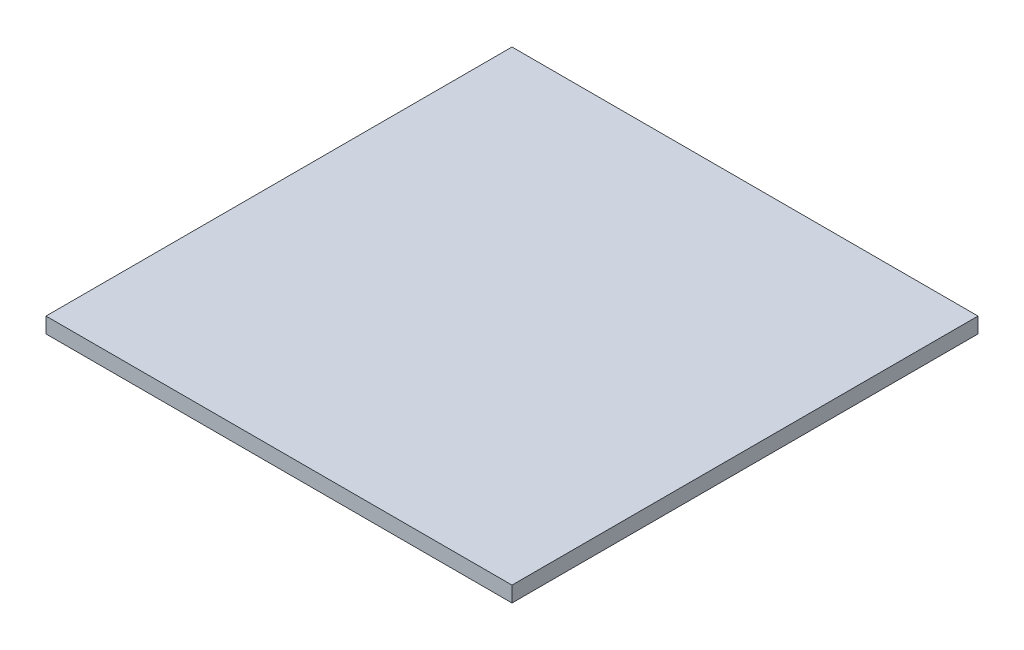
ISO-10303-21;
HEADER;
FILE_DESCRIPTION(('STEP AP214'),'2;1');
FILE_NAME('part.step','',(''),(''),'','','');
FILE_SCHEMA(('AUTOMOTIVE_DESIGN { 1 0 10303 214 1 1 1 1 }'));
ENDSEC;
DATA;
#1=APPLICATION_CONTEXT('core data for automotive mechanical design processes');
#2=APPLICATION_PROTOCOL_DEFINITION('international standard','automotive_design',2000,#1);
#3=PRODUCT_CONTEXT('',#1,'mechanical');
#4=PRODUCT('Part','Part','',(#3));
#5=PRODUCT_RELATED_PRODUCT_CATEGORY('part','',(#4));
#6=PRODUCT_DEFINITION_FORMATION('','',#4);
#7=PRODUCT_DEFINITION_CONTEXT('part definition',#1,'design');
#8=PRODUCT_DEFINITION('design','',#6,#7);
#9=PRODUCT_DEFINITION_SHAPE('','',#8);
#10=(LENGTH_UNIT() NAMED_UNIT(*) SI_UNIT(.MILLI.,.METRE.));
#11=(NAMED_UNIT(*) PLANE_ANGLE_UNIT() SI_UNIT($,.RADIAN.));
#12=(NAMED_UNIT(*) SI_UNIT($,.STERADIAN.) SOLID_ANGLE_UNIT());
#13=UNCERTAINTY_MEASURE_WITH_UNIT(LENGTH_MEASURE(1.E-05),#10,'distance_accuracy_value','');
#14=(GEOMETRIC_REPRESENTATION_CONTEXT(3) GLOBAL_UNCERTAINTY_ASSIGNED_CONTEXT((#13)) GLOBAL_UNIT_ASSIGNED_CONTEXT((#10,
#11,#12)) REPRESENTATION_CONTEXT('',''));
#15=CARTESIAN_POINT('',(0.,0.,0.));
#16=DIRECTION('',(0.,0.,1.));
#17=DIRECTION('',(1.,0.,0.));
#18=AXIS2_PLACEMENT_3D('',#15,#16,#17);
#19=CARTESIAN_POINT('',(0.,10.,0.));
#20=DIRECTION('',(1.,0.,0.));
#21=DIRECTION('',(0.,0.,-1.));
#22=AXIS2_PLACEMENT_3D('',#19,#20,#21);
#23=PLANE('',#22);
#24=DIRECTION('',(0.,0.,1.));
#25=VECTOR('',#24,1.);
#26=CARTESIAN_POINT('',(0.,0.,0.));
#27=LINE('',#26,#25);
#28=CARTESIAN_POINT('',(0.,0.,-300.));
#29=VERTEX_POINT('',#28);
#30=CARTESIAN_POINT('',(0.,0.,0.));
#31=VERTEX_POINT('',#30);
#32=EDGE_CURVE('E107',#29,#31,#27,.T.);
#33=ORIENTED_EDGE('',*,*,#32,.T.);
#34=DIRECTION('',(0.,-1.,0.));
#35=VECTOR('',#34,1.);
#36=CARTESIAN_POINT('',(0.,10.,0.));
#37=LINE('',#36,#35);
#38=CARTESIAN_POINT('',(0.,10.,0.));
#39=VERTEX_POINT('',#38);
#40=EDGE_CURVE('E11',#39,#31,#37,.T.);
#41=ORIENTED_EDGE('',*,*,#40,.F.);
#42=DIRECTION('',(0.,0.,1.));
#43=VECTOR('',#42,1.);
#44=CARTESIAN_POINT('',(0.,10.,0.));
#45=LINE('',#44,#43);
#46=CARTESIAN_POINT('',(0.,10.,-300.));
#47=VERTEX_POINT('',#46);
#48=EDGE_CURVE('E91',#47,#39,#45,.T.);
#49=ORIENTED_EDGE('',*,*,#48,.F.);
#50=DIRECTION('',(0.,-1.,0.));
#51=VECTOR('',#50,1.);
#52=CARTESIAN_POINT('',(0.,10.,-300.));
#53=LINE('',#52,#51);
#54=EDGE_CURVE('E103',#47,#29,#53,.T.);
#55=ORIENTED_EDGE('',*,*,#54,.T.);
#56=EDGE_LOOP('',(#33,#41,#49,#55));
#57=FACE_BOUND('',#56,.T.);
#58=ADVANCED_FACE('F39',(#57),#23,.F.);
#59=CARTESIAN_POINT('',(0.,10.,0.));
#60=DIRECTION('',(0.,0.,-1.));
#61=DIRECTION('',(-1.,0.,0.));
#62=AXIS2_PLACEMENT_3D('',#59,#60,#61);
#63=PLANE('',#62);
#64=DIRECTION('',(1.,0.,0.));
#65=VECTOR('',#64,1.);
#66=CARTESIAN_POINT('',(0.,0.,0.));
#67=LINE('',#66,#65);
#68=CARTESIAN_POINT('',(300.,0.,0.));
#69=VERTEX_POINT('',#68);
#70=EDGE_CURVE('E96',#31,#69,#67,.T.);
#71=ORIENTED_EDGE('',*,*,#70,.T.);
#72=DIRECTION('',(0.,-1.,0.));
#73=VECTOR('',#72,1.);
#74=CARTESIAN_POINT('',(300.,10.,0.));
#75=LINE('',#74,#73);
#76=CARTESIAN_POINT('',(300.,10.,0.));
#77=VERTEX_POINT('',#76);
#78=EDGE_CURVE('E48',#77,#69,#75,.T.);
#79=ORIENTED_EDGE('',*,*,#78,.F.);
#80=DIRECTION('',(1.,0.,0.));
#81=VECTOR('',#80,1.);
#82=CARTESIAN_POINT('',(0.,10.,0.));
#83=LINE('',#82,#81);
#84=EDGE_CURVE('E86',#39,#77,#83,.T.);
#85=ORIENTED_EDGE('',*,*,#84,.F.);
#86=ORIENTED_EDGE('',*,*,#40,.T.);
#87=EDGE_LOOP('',(#71,#79,#85,#86));
#88=FACE_BOUND('',#87,.T.);
#89=ADVANCED_FACE('F95',(#88),#63,.F.);
#90=CARTESIAN_POINT('',(300.,10.,0.));
#91=DIRECTION('',(-1.,0.,0.));
#92=DIRECTION('',(0.,0.,1.));
#93=AXIS2_PLACEMENT_3D('',#90,#91,#92);
#94=PLANE('',#93);
#95=DIRECTION('',(0.,0.,-1.));
#96=VECTOR('',#95,1.);
#97=CARTESIAN_POINT('',(300.,0.,0.));
#98=LINE('',#97,#96);
#99=CARTESIAN_POINT('',(300.,0.,-300.));
#100=VERTEX_POINT('',#99);
#101=EDGE_CURVE('E73',#69,#100,#98,.T.);
#102=ORIENTED_EDGE('',*,*,#101,.T.);
#103=DIRECTION('',(0.,-1.,0.));
#104=VECTOR('',#103,1.);
#105=CARTESIAN_POINT('',(300.,10.,-300.));
#106=LINE('',#105,#104);
#107=CARTESIAN_POINT('',(300.,10.,-300.));
#108=VERTEX_POINT('',#107);
#109=EDGE_CURVE('E98',#108,#100,#106,.T.);
#110=ORIENTED_EDGE('',*,*,#109,.F.);
#111=DIRECTION('',(0.,0.,-1.));
#112=VECTOR('',#111,1.);
#113=CARTESIAN_POINT('',(300.,10.,0.));
#114=LINE('',#113,#112);
#115=EDGE_CURVE('E89',#77,#108,#114,.T.);
#116=ORIENTED_EDGE('',*,*,#115,.F.);
#117=ORIENTED_EDGE('',*,*,#78,.T.);
#118=EDGE_LOOP('',(#102,#110,#116,#117));
#119=FACE_BOUND('',#118,.T.);
#120=ADVANCED_FACE('F99',(#119),#94,.F.);
#121=CARTESIAN_POINT('',(0.,10.,-300.));
#122=DIRECTION('',(0.,0.,1.));
#123=DIRECTION('',(1.,0.,0.));
#124=AXIS2_PLACEMENT_3D('',#121,#122,#123);
#125=PLANE('',#124);
#126=DIRECTION('',(-1.,0.,0.));
#127=VECTOR('',#126,1.);
#128=CARTESIAN_POINT('',(0.,0.,-300.));
#129=LINE('',#128,#127);
#130=EDGE_CURVE('E79',#100,#29,#129,.T.);
#131=ORIENTED_EDGE('',*,*,#130,.T.);
#132=ORIENTED_EDGE('',*,*,#54,.F.);
#133=DIRECTION('',(-1.,0.,0.));
#134=VECTOR('',#133,1.);
#135=CARTESIAN_POINT('',(0.,10.,-300.));
#136=LINE('',#135,#134);
#137=EDGE_CURVE('E56',#108,#47,#136,.T.);
#138=ORIENTED_EDGE('',*,*,#137,.F.);
#139=ORIENTED_EDGE('',*,*,#109,.T.);
#140=EDGE_LOOP('',(#131,#132,#138,#139));
#141=FACE_BOUND('',#140,.T.);
#142=ADVANCED_FACE('F120',(#141),#125,.F.);
#143=CARTESIAN_POINT('',(0.,10.,0.));
#144=DIRECTION('',(0.,-1.,0.));
#145=DIRECTION('',(0.,0.,-1.));
#146=AXIS2_PLACEMENT_3D('',#143,#144,#145);
#147=PLANE('',#146);
#148=ORIENTED_EDGE('',*,*,#48,.T.);
#149=ORIENTED_EDGE('',*,*,#84,.T.);
#150=ORIENTED_EDGE('',*,*,#115,.T.);
#151=ORIENTED_EDGE('',*,*,#137,.T.);
#152=EDGE_LOOP('',(#148,#149,#150,#151));
#153=FACE_BOUND('',#152,.T.);
#154=ADVANCED_FACE('F87',(#153),#147,.F.);
#155=CARTESIAN_POINT('',(0.,0.,0.));
#156=DIRECTION('',(0.,-1.,0.));
#157=DIRECTION('',(0.,0.,-1.));
#158=AXIS2_PLACEMENT_3D('',#155,#156,#157);
#159=PLANE('',#158);
#160=ORIENTED_EDGE('',*,*,#32,.F.);
#161=ORIENTED_EDGE('',*,*,#130,.F.);
#162=ORIENTED_EDGE('',*,*,#101,.F.);
#163=ORIENTED_EDGE('',*,*,#70,.F.);
#164=EDGE_LOOP('',(#160,#161,#162,#163));
#165=FACE_BOUND('',#164,.T.);
#166=ADVANCED_FACE('F123',(#165),#159,.T.);
#167=CLOSED_SHELL('',(#58,#89,#120,#142,#154,#166));
#168=MANIFOLD_SOLID_BREP('B2',#167);
#169=ADVANCED_BREP_SHAPE_REPRESENTATION('',(#18,#168),#14);
#170=SHAPE_DEFINITION_REPRESENTATION(#9,#169);
ENDSEC;
END-ISO-10303-21;
